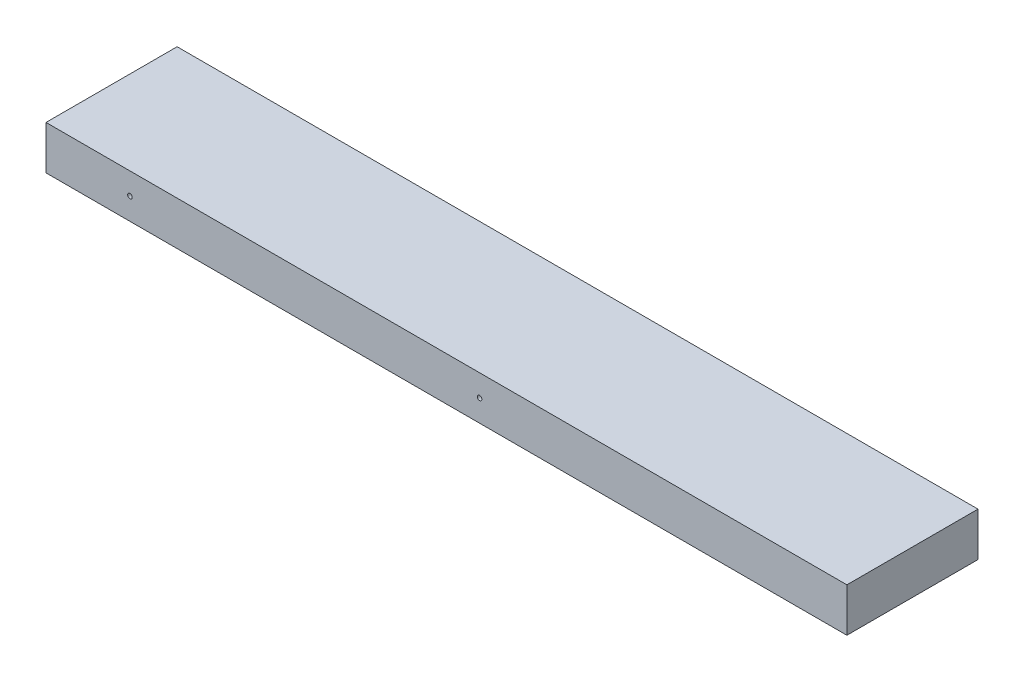
ISO-10303-21;
HEADER;
FILE_DESCRIPTION(('STEP AP214'),'2;1');
FILE_NAME('part.step','',(''),(''),'','','');
FILE_SCHEMA(('AUTOMOTIVE_DESIGN { 1 0 10303 214 1 1 1 1 }'));
ENDSEC;
DATA;
#1=APPLICATION_CONTEXT('core data for automotive mechanical design processes');
#2=APPLICATION_PROTOCOL_DEFINITION('international standard','automotive_design',2000,#1);
#3=PRODUCT_CONTEXT('',#1,'mechanical');
#4=PRODUCT('Part','Part','',(#3));
#5=PRODUCT_RELATED_PRODUCT_CATEGORY('part','',(#4));
#6=PRODUCT_DEFINITION_FORMATION('','',#4);
#7=PRODUCT_DEFINITION_CONTEXT('part definition',#1,'design');
#8=PRODUCT_DEFINITION('design','',#6,#7);
#9=PRODUCT_DEFINITION_SHAPE('','',#8);
#10=(LENGTH_UNIT() NAMED_UNIT(*) SI_UNIT(.MILLI.,.METRE.));
#11=(NAMED_UNIT(*) PLANE_ANGLE_UNIT() SI_UNIT($,.RADIAN.));
#12=(NAMED_UNIT(*) SI_UNIT($,.STERADIAN.) SOLID_ANGLE_UNIT());
#13=UNCERTAINTY_MEASURE_WITH_UNIT(LENGTH_MEASURE(1.E-05),#10,'distance_accuracy_value','');
#14=(GEOMETRIC_REPRESENTATION_CONTEXT(3) GLOBAL_UNCERTAINTY_ASSIGNED_CONTEXT((#13)) GLOBAL_UNIT_ASSIGNED_CONTEXT((#10,
#11,#12)) REPRESENTATION_CONTEXT('',''));
#15=CARTESIAN_POINT('',(0.,0.,0.));
#16=DIRECTION('',(0.,0.,1.));
#17=DIRECTION('',(1.,0.,0.));
#18=AXIS2_PLACEMENT_3D('',#15,#16,#17);
#19=CARTESIAN_POINT('',(86.3599999999995,5213.35,2683.51));
#20=DIRECTION('',(0.,-1.,0.));
#21=DIRECTION('',(0.,0.,-1.));
#22=AXIS2_PLACEMENT_3D('',#19,#20,#21);
#23=PLANE('',#22);
#24=DIRECTION('',(0.,0.,-1.));
#25=VECTOR('',#24,1.);
#26=CARTESIAN_POINT('',(96.1779514960055,5213.35,2740.66));
#27=LINE('',#26,#25);
#28=CARTESIAN_POINT('',(96.1779514960055,5213.35,2740.66));
#29=VERTEX_POINT('',#28);
#30=CARTESIAN_POINT('',(96.1779514960055,5213.35,2683.51));
#31=VERTEX_POINT('',#30);
#32=EDGE_CURVE('E99',#29,#31,#27,.T.);
#33=ORIENTED_EDGE('',*,*,#32,.T.);
#34=DIRECTION('',(1.,0.,0.));
#35=VECTOR('',#34,1.);
#36=CARTESIAN_POINT('',(265.815570864871,5213.35,2683.51));
#37=LINE('',#36,#35);
#38=CARTESIAN_POINT('',(445.271141729743,5213.35,2683.51));
#39=VERTEX_POINT('',#38);
#40=EDGE_CURVE('E153',#31,#39,#37,.T.);
#41=ORIENTED_EDGE('',*,*,#40,.T.);
#42=DIRECTION('',(0.,0.,-1.));
#43=VECTOR('',#42,1.);
#44=CARTESIAN_POINT('',(445.271141729743,5213.35,2683.51));
#45=LINE('',#44,#43);
#46=CARTESIAN_POINT('',(445.271141729743,5213.35,2740.66));
#47=VERTEX_POINT('',#46);
#48=EDGE_CURVE('E112',#47,#39,#45,.T.);
#49=ORIENTED_EDGE('',*,*,#48,.F.);
#50=DIRECTION('',(-1.,0.,0.));
#51=VECTOR('',#50,1.);
#52=CARTESIAN_POINT('',(265.815570864871,5213.35,2740.66));
#53=LINE('',#52,#51);
#54=EDGE_CURVE('E75',#47,#29,#53,.T.);
#55=ORIENTED_EDGE('',*,*,#54,.T.);
#56=EDGE_LOOP('',(#33,#41,#49,#55));
#57=FACE_BOUND('',#56,.T.);
#58=ADVANCED_FACE('F35',(#57),#23,.T.);
#59=CARTESIAN_POINT('',(265.815570864871,5222.875,2740.66));
#60=DIRECTION('',(0.,0.,-1.));
#61=DIRECTION('',(-1.,0.,0.));
#62=AXIS2_PLACEMENT_3D('',#59,#60,#61);
#63=PLANE('',#62);
#64=CARTESIAN_POINT('',(132.773222798989,5222.875,2740.66));
#65=DIRECTION('',(0.,0.,-1.));
#66=DIRECTION('',(-1.,0.,0.));
#67=AXIS2_PLACEMENT_3D('',#64,#65,#66);
#68=CIRCLE('',#67,0.991870000000006);
#69=CARTESIAN_POINT('',(131.781352798989,5222.875,2740.66));
#70=VERTEX_POINT('',#69);
#71=EDGE_CURVE('E38',#70,#70,#68,.T.);
#72=ORIENTED_EDGE('',*,*,#71,.T.);
#73=EDGE_LOOP('',(#72));
#74=FACE_BOUND('',#73,.T.);
#75=CARTESIAN_POINT('',(285.173222798989,5222.875,2740.66));
#76=DIRECTION('',(0.,0.,-1.));
#77=DIRECTION('',(-1.,0.,0.));
#78=AXIS2_PLACEMENT_3D('',#75,#76,#77);
#79=CIRCLE('',#78,0.991870000000006);
#80=CARTESIAN_POINT('',(284.181352798989,5222.875,2740.66));
#81=VERTEX_POINT('',#80);
#82=EDGE_CURVE('E130',#81,#81,#79,.T.);
#83=ORIENTED_EDGE('',*,*,#82,.T.);
#84=EDGE_LOOP('',(#83));
#85=FACE_BOUND('',#84,.T.);
#86=DIRECTION('',(1.,0.,0.));
#87=VECTOR('',#86,1.);
#88=CARTESIAN_POINT('',(445.271141729743,5232.4,2740.66));
#89=LINE('',#88,#87);
#90=CARTESIAN_POINT('',(96.1779514960055,5232.4,2740.66));
#91=VERTEX_POINT('',#90);
#92=CARTESIAN_POINT('',(445.271141729743,5232.4,2740.66));
#93=VERTEX_POINT('',#92);
#94=EDGE_CURVE('E110',#91,#93,#89,.T.);
#95=ORIENTED_EDGE('',*,*,#94,.F.);
#96=DIRECTION('',(0.,-1.,0.));
#97=VECTOR('',#96,1.);
#98=CARTESIAN_POINT('',(96.1779514960055,5213.35,2740.66));
#99=LINE('',#98,#97);
#100=EDGE_CURVE('E51',#91,#29,#99,.T.);
#101=ORIENTED_EDGE('',*,*,#100,.T.);
#102=ORIENTED_EDGE('',*,*,#54,.F.);
#103=DIRECTION('',(0.,1.,0.));
#104=VECTOR('',#103,1.);
#105=CARTESIAN_POINT('',(445.271141729743,5213.35,2740.66));
#106=LINE('',#105,#104);
#107=EDGE_CURVE('E114',#93,#47,#106,.F.);
#108=ORIENTED_EDGE('',*,*,#107,.F.);
#109=EDGE_LOOP('',(#95,#101,#102,#108));
#110=FACE_BOUND('',#109,.T.);
#111=ADVANCED_FACE('F109',(#74,#85,#110),#63,.F.);
#112=CARTESIAN_POINT('',(445.271141729743,5213.35,2683.51));
#113=DIRECTION('',(1.,0.,0.));
#114=DIRECTION('',(0.,0.,-1.));
#115=AXIS2_PLACEMENT_3D('',#112,#113,#114);
#116=PLANE('',#115);
#117=DIRECTION('',(0.,1.,0.));
#118=VECTOR('',#117,1.);
#119=CARTESIAN_POINT('',(445.271141729743,5222.875,2683.51));
#120=LINE('',#119,#118);
#121=CARTESIAN_POINT('',(445.271141729743,5232.4,2683.51));
#122=VERTEX_POINT('',#121);
#123=EDGE_CURVE('E60',#39,#122,#120,.T.);
#124=ORIENTED_EDGE('',*,*,#123,.T.);
#125=DIRECTION('',(0.,0.,1.));
#126=VECTOR('',#125,1.);
#127=CARTESIAN_POINT('',(445.271141729743,5232.4,2683.51));
#128=LINE('',#127,#126);
#129=EDGE_CURVE('E43',#93,#122,#128,.F.);
#130=ORIENTED_EDGE('',*,*,#129,.F.);
#131=ORIENTED_EDGE('',*,*,#107,.T.);
#132=ORIENTED_EDGE('',*,*,#48,.T.);
#133=EDGE_LOOP('',(#124,#130,#131,#132));
#134=FACE_BOUND('',#133,.T.);
#135=ADVANCED_FACE('F154',(#134),#116,.T.);
#136=CARTESIAN_POINT('',(265.815570864871,5222.875,2683.51));
#137=DIRECTION('',(0.,0.,1.));
#138=DIRECTION('',(1.,0.,0.));
#139=AXIS2_PLACEMENT_3D('',#136,#137,#138);
#140=PLANE('',#139);
#141=CARTESIAN_POINT('',(412.173222798989,5222.875,2683.51));
#142=DIRECTION('',(0.,0.,1.));
#143=DIRECTION('',(1.,0.,0.));
#144=AXIS2_PLACEMENT_3D('',#141,#142,#143);
#145=CIRCLE('',#144,0.991870000000006);
#146=CARTESIAN_POINT('',(413.165092798989,5222.875,2683.51));
#147=VERTEX_POINT('',#146);
#148=EDGE_CURVE('E127',#147,#147,#145,.T.);
#149=ORIENTED_EDGE('',*,*,#148,.T.);
#150=EDGE_LOOP('',(#149));
#151=FACE_BOUND('',#150,.T.);
#152=CARTESIAN_POINT('',(310.573222798989,5222.875,2683.51));
#153=DIRECTION('',(0.,0.,1.));
#154=DIRECTION('',(1.,0.,0.));
#155=AXIS2_PLACEMENT_3D('',#152,#153,#154);
#156=CIRCLE('',#155,0.991870000000006);
#157=CARTESIAN_POINT('',(311.565092798989,5222.875,2683.51));
#158=VERTEX_POINT('',#157);
#159=EDGE_CURVE('E123',#158,#158,#156,.T.);
#160=ORIENTED_EDGE('',*,*,#159,.T.);
#161=EDGE_LOOP('',(#160));
#162=FACE_BOUND('',#161,.T.);
#163=CARTESIAN_POINT('',(107.373222798989,5222.875,2683.51));
#164=DIRECTION('',(0.,0.,1.));
#165=DIRECTION('',(1.,0.,0.));
#166=AXIS2_PLACEMENT_3D('',#163,#164,#165);
#167=CIRCLE('',#166,0.991870000000006);
#168=CARTESIAN_POINT('',(108.365092798989,5222.875,2683.51));
#169=VERTEX_POINT('',#168);
#170=EDGE_CURVE('E115',#169,#169,#167,.T.);
#171=ORIENTED_EDGE('',*,*,#170,.T.);
#172=EDGE_LOOP('',(#171));
#173=FACE_BOUND('',#172,.T.);
#174=ORIENTED_EDGE('',*,*,#40,.F.);
#175=DIRECTION('',(0.,-1.,0.));
#176=VECTOR('',#175,1.);
#177=CARTESIAN_POINT('',(96.1779514960055,5213.35,2683.51));
#178=LINE('',#177,#176);
#179=CARTESIAN_POINT('',(96.1779514960055,5232.4,2683.51));
#180=VERTEX_POINT('',#179);
#181=EDGE_CURVE('E102',#180,#31,#178,.T.);
#182=ORIENTED_EDGE('',*,*,#181,.F.);
#183=DIRECTION('',(1.,0.,0.));
#184=VECTOR('',#183,1.);
#185=CARTESIAN_POINT('',(445.271141729743,5232.4,2683.51));
#186=LINE('',#185,#184);
#187=EDGE_CURVE('E11',#122,#180,#186,.F.);
#188=ORIENTED_EDGE('',*,*,#187,.F.);
#189=ORIENTED_EDGE('',*,*,#123,.F.);
#190=EDGE_LOOP('',(#174,#182,#188,#189));
#191=FACE_BOUND('',#190,.T.);
#192=ADVANCED_FACE('F156',(#151,#162,#173,#191),#140,.F.);
#193=CARTESIAN_POINT('',(445.271141729743,5232.4,2683.51));
#194=DIRECTION('',(0.,1.,0.));
#195=DIRECTION('',(0.,0.,1.));
#196=AXIS2_PLACEMENT_3D('',#193,#194,#195);
#197=PLANE('',#196);
#198=DIRECTION('',(0.,0.,-1.));
#199=VECTOR('',#198,1.);
#200=CARTESIAN_POINT('',(96.1779514960055,5232.4,2740.66));
#201=LINE('',#200,#199);
#202=EDGE_CURVE('E106',#91,#180,#201,.T.);
#203=ORIENTED_EDGE('',*,*,#202,.F.);
#204=ORIENTED_EDGE('',*,*,#94,.T.);
#205=ORIENTED_EDGE('',*,*,#129,.T.);
#206=ORIENTED_EDGE('',*,*,#187,.T.);
#207=EDGE_LOOP('',(#203,#204,#205,#206));
#208=FACE_BOUND('',#207,.T.);
#209=ADVANCED_FACE('F158',(#208),#197,.T.);
#210=CARTESIAN_POINT('',(107.373222798989,5222.875,2664.46));
#211=DIRECTION('',(0.,0.,-1.));
#212=DIRECTION('',(-1.,0.,0.));
#213=AXIS2_PLACEMENT_3D('',#210,#211,#212);
#214=CYLINDRICAL_SURFACE('',#213,0.991870000000006);
#215=CARTESIAN_POINT('',(107.373222798989,5222.875,2702.56));
#216=DIRECTION('',(0.,0.,-1.));
#217=DIRECTION('',(-1.,0.,0.));
#218=AXIS2_PLACEMENT_3D('',#215,#216,#217);
#219=CIRCLE('',#218,0.991870000000006);
#220=CARTESIAN_POINT('',(106.381352798989,5222.875,2702.56));
#221=VERTEX_POINT('',#220);
#222=EDGE_CURVE('E119',#221,#221,#219,.T.);
#223=ORIENTED_EDGE('',*,*,#222,.F.);
#224=EDGE_LOOP('',(#223));
#225=FACE_BOUND('',#224,.T.);
#226=ORIENTED_EDGE('',*,*,#170,.F.);
#227=EDGE_LOOP('',(#226));
#228=FACE_BOUND('',#227,.T.);
#229=ADVANCED_FACE('F161',(#225,#228),#214,.F.);
#230=CARTESIAN_POINT('',(107.373222798989,5222.875,2702.56));
#231=DIRECTION('',(0.,0.,-1.));
#232=DIRECTION('',(-1.,0.,0.));
#233=AXIS2_PLACEMENT_3D('',#230,#231,#232);
#234=CONICAL_SURFACE('',#233,0.991870000000006,1.02974425867677);
#235=CARTESIAN_POINT('',(107.373222798989,5222.875,2703.1559756222));
#236=VERTEX_POINT('',#235);
#237=VERTEX_LOOP('',#236);
#238=FACE_BOUND('',#237,.T.);
#239=ORIENTED_EDGE('',*,*,#222,.T.);
#240=EDGE_LOOP('',(#239));
#241=FACE_BOUND('',#240,.T.);
#242=ADVANCED_FACE('F167',(#238,#241),#234,.F.);
#243=CARTESIAN_POINT('',(310.573222798989,5222.875,2664.46));
#244=DIRECTION('',(0.,0.,-1.));
#245=DIRECTION('',(-1.,0.,0.));
#246=AXIS2_PLACEMENT_3D('',#243,#244,#245);
#247=CYLINDRICAL_SURFACE('',#246,0.991870000000006);
#248=CARTESIAN_POINT('',(310.573222798989,5222.875,2702.56));
#249=DIRECTION('',(0.,0.,-1.));
#250=DIRECTION('',(-1.,0.,0.));
#251=AXIS2_PLACEMENT_3D('',#248,#249,#250);
#252=CIRCLE('',#251,0.991870000000006);
#253=CARTESIAN_POINT('',(309.581352798989,5222.875,2702.56));
#254=VERTEX_POINT('',#253);
#255=EDGE_CURVE('E126',#254,#254,#252,.T.);
#256=ORIENTED_EDGE('',*,*,#255,.F.);
#257=EDGE_LOOP('',(#256));
#258=FACE_BOUND('',#257,.T.);
#259=ORIENTED_EDGE('',*,*,#159,.F.);
#260=EDGE_LOOP('',(#259));
#261=FACE_BOUND('',#260,.T.);
#262=ADVANCED_FACE('F212',(#258,#261),#247,.F.);
#263=CARTESIAN_POINT('',(310.573222798989,5222.875,2702.56));
#264=DIRECTION('',(0.,0.,-1.));
#265=DIRECTION('',(-1.,0.,0.));
#266=AXIS2_PLACEMENT_3D('',#263,#264,#265);
#267=CONICAL_SURFACE('',#266,0.991870000000006,1.02974425867677);
#268=CARTESIAN_POINT('',(310.573222798989,5222.875,2703.1559756222));
#269=VERTEX_POINT('',#268);
#270=VERTEX_LOOP('',#269);
#271=FACE_BOUND('',#270,.T.);
#272=ORIENTED_EDGE('',*,*,#255,.T.);
#273=EDGE_LOOP('',(#272));
#274=FACE_BOUND('',#273,.T.);
#275=ADVANCED_FACE('F207',(#271,#274),#267,.F.);
#276=CARTESIAN_POINT('',(412.173222798989,5222.875,2664.46));
#277=DIRECTION('',(0.,0.,-1.));
#278=DIRECTION('',(-1.,0.,0.));
#279=AXIS2_PLACEMENT_3D('',#276,#277,#278);
#280=CYLINDRICAL_SURFACE('',#279,0.991870000000006);
#281=CARTESIAN_POINT('',(412.173222798989,5222.875,2702.56));
#282=DIRECTION('',(0.,0.,-1.));
#283=DIRECTION('',(-1.,0.,0.));
#284=AXIS2_PLACEMENT_3D('',#281,#282,#283);
#285=CIRCLE('',#284,0.991870000000006);
#286=CARTESIAN_POINT('',(411.181352798989,5222.875,2702.56));
#287=VERTEX_POINT('',#286);
#288=EDGE_CURVE('E129',#287,#287,#285,.T.);
#289=ORIENTED_EDGE('',*,*,#288,.F.);
#290=EDGE_LOOP('',(#289));
#291=FACE_BOUND('',#290,.T.);
#292=ORIENTED_EDGE('',*,*,#148,.F.);
#293=EDGE_LOOP('',(#292));
#294=FACE_BOUND('',#293,.T.);
#295=ADVANCED_FACE('F204',(#291,#294),#280,.F.);
#296=CARTESIAN_POINT('',(412.173222798989,5222.875,2702.56));
#297=DIRECTION('',(0.,0.,-1.));
#298=DIRECTION('',(-1.,0.,0.));
#299=AXIS2_PLACEMENT_3D('',#296,#297,#298);
#300=CONICAL_SURFACE('',#299,0.991870000000006,1.02974425867677);
#301=CARTESIAN_POINT('',(412.173222798989,5222.875,2703.1559756222));
#302=VERTEX_POINT('',#301);
#303=VERTEX_LOOP('',#302);
#304=FACE_BOUND('',#303,.T.);
#305=ORIENTED_EDGE('',*,*,#288,.T.);
#306=EDGE_LOOP('',(#305));
#307=FACE_BOUND('',#306,.T.);
#308=ADVANCED_FACE('F201',(#304,#307),#300,.F.);
#309=CARTESIAN_POINT('',(285.173222798989,5222.875,2759.71000000001));
#310=DIRECTION('',(0.,0.,1.));
#311=DIRECTION('',(1.,0.,0.));
#312=AXIS2_PLACEMENT_3D('',#309,#310,#311);
#313=CYLINDRICAL_SURFACE('',#312,0.991870000000006);
#314=CARTESIAN_POINT('',(285.173222798989,5222.875,2721.61000000001));
#315=DIRECTION('',(0.,0.,1.));
#316=DIRECTION('',(1.,0.,0.));
#317=AXIS2_PLACEMENT_3D('',#314,#315,#316);
#318=CIRCLE('',#317,0.991870000000006);
#319=CARTESIAN_POINT('',(286.165092798989,5222.875,2721.61000000001));
#320=VERTEX_POINT('',#319);
#321=EDGE_CURVE('E132',#320,#320,#318,.T.);
#322=ORIENTED_EDGE('',*,*,#321,.F.);
#323=EDGE_LOOP('',(#322));
#324=FACE_BOUND('',#323,.T.);
#325=ORIENTED_EDGE('',*,*,#82,.F.);
#326=EDGE_LOOP('',(#325));
#327=FACE_BOUND('',#326,.T.);
#328=ADVANCED_FACE('F194',(#324,#327),#313,.F.);
#329=CARTESIAN_POINT('',(285.173222798989,5222.875,2721.61000000001));
#330=DIRECTION('',(0.,0.,1.));
#331=DIRECTION('',(1.,0.,0.));
#332=AXIS2_PLACEMENT_3D('',#329,#330,#331);
#333=CONICAL_SURFACE('',#332,0.991870000000006,1.02974425867677);
#334=CARTESIAN_POINT('',(285.173222798989,5222.875,2721.01402437781));
#335=VERTEX_POINT('',#334);
#336=VERTEX_LOOP('',#335);
#337=FACE_BOUND('',#336,.T.);
#338=ORIENTED_EDGE('',*,*,#321,.T.);
#339=EDGE_LOOP('',(#338));
#340=FACE_BOUND('',#339,.T.);
#341=ADVANCED_FACE('F185',(#337,#340),#333,.F.);
#342=CARTESIAN_POINT('',(132.773222798989,5222.875,2759.71000000001));
#343=DIRECTION('',(0.,0.,1.));
#344=DIRECTION('',(1.,0.,0.));
#345=AXIS2_PLACEMENT_3D('',#342,#343,#344);
#346=CYLINDRICAL_SURFACE('',#345,0.991870000000006);
#347=CARTESIAN_POINT('',(132.773222798989,5222.875,2721.61000000001));
#348=DIRECTION('',(0.,0.,1.));
#349=DIRECTION('',(1.,0.,0.));
#350=AXIS2_PLACEMENT_3D('',#347,#348,#349);
#351=CIRCLE('',#350,0.991870000000006);
#352=CARTESIAN_POINT('',(133.765092798989,5222.875,2721.61000000001));
#353=VERTEX_POINT('',#352);
#354=EDGE_CURVE('E105',#353,#353,#351,.T.);
#355=ORIENTED_EDGE('',*,*,#354,.F.);
#356=EDGE_LOOP('',(#355));
#357=FACE_BOUND('',#356,.T.);
#358=ORIENTED_EDGE('',*,*,#71,.F.);
#359=EDGE_LOOP('',(#358));
#360=FACE_BOUND('',#359,.T.);
#361=ADVANCED_FACE('F182',(#357,#360),#346,.F.);
#362=CARTESIAN_POINT('',(132.773222798989,5222.875,2721.61000000001));
#363=DIRECTION('',(0.,0.,1.));
#364=DIRECTION('',(1.,0.,0.));
#365=AXIS2_PLACEMENT_3D('',#362,#363,#364);
#366=CONICAL_SURFACE('',#365,0.991870000000006,1.02974425867677);
#367=CARTESIAN_POINT('',(132.773222798989,5222.875,2721.01402437781));
#368=VERTEX_POINT('',#367);
#369=VERTEX_LOOP('',#368);
#370=FACE_BOUND('',#369,.T.);
#371=ORIENTED_EDGE('',*,*,#354,.T.);
#372=EDGE_LOOP('',(#371));
#373=FACE_BOUND('',#372,.T.);
#374=ADVANCED_FACE('F184',(#370,#373),#366,.F.);
#375=CARTESIAN_POINT('',(96.1779514960055,5213.35,2740.66));
#376=DIRECTION('',(1.,0.,0.));
#377=DIRECTION('',(0.,0.,-1.));
#378=AXIS2_PLACEMENT_3D('',#375,#376,#377);
#379=PLANE('',#378);
#380=ORIENTED_EDGE('',*,*,#181,.T.);
#381=ORIENTED_EDGE('',*,*,#32,.F.);
#382=ORIENTED_EDGE('',*,*,#100,.F.);
#383=ORIENTED_EDGE('',*,*,#202,.T.);
#384=EDGE_LOOP('',(#380,#381,#382,#383));
#385=FACE_BOUND('',#384,.T.);
#386=ADVANCED_FACE('F100',(#385),#379,.F.);
#387=CLOSED_SHELL('',(#58,#111,#135,#192,#209,#229,#242,#262,#275,#295,#308,#328,#341,#361,#374,#386));
#388=MANIFOLD_SOLID_BREP('B2',#387);
#389=ADVANCED_BREP_SHAPE_REPRESENTATION('',(#18,#388),#14);
#390=SHAPE_DEFINITION_REPRESENTATION(#9,#389);
ENDSEC;
END-ISO-10303-21;
